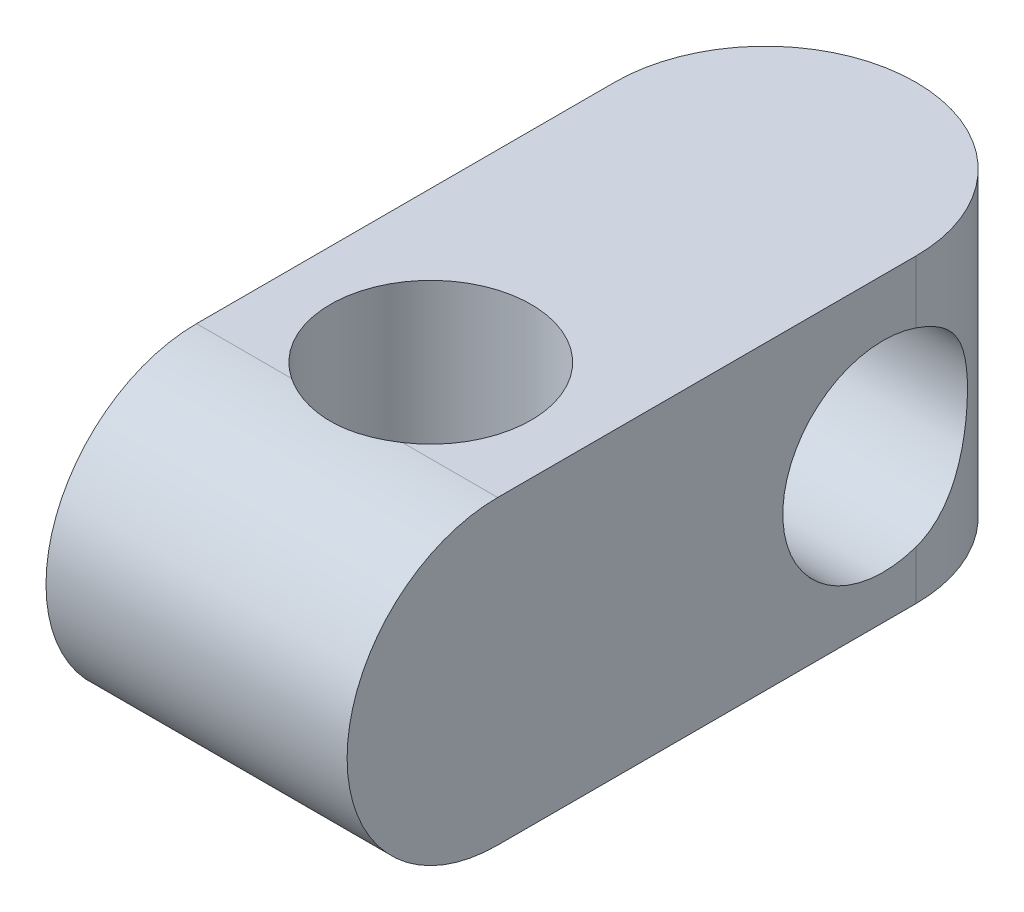
ISO-10303-21;
HEADER;
FILE_DESCRIPTION(('STEP AP214'),'2;1');
FILE_NAME('part.step','',(''),(''),'','','');
FILE_SCHEMA(('AUTOMOTIVE_DESIGN { 1 0 10303 214 1 1 1 1 }'));
ENDSEC;
DATA;
#1=APPLICATION_CONTEXT('core data for automotive mechanical design processes');
#2=APPLICATION_PROTOCOL_DEFINITION('international standard','automotive_design',2000,#1);
#3=PRODUCT_CONTEXT('',#1,'mechanical');
#4=PRODUCT('Part','Part','',(#3));
#5=PRODUCT_RELATED_PRODUCT_CATEGORY('part','',(#4));
#6=PRODUCT_DEFINITION_FORMATION('','',#4);
#7=PRODUCT_DEFINITION_CONTEXT('part definition',#1,'design');
#8=PRODUCT_DEFINITION('design','',#6,#7);
#9=PRODUCT_DEFINITION_SHAPE('','',#8);
#10=(LENGTH_UNIT() NAMED_UNIT(*) SI_UNIT(.MILLI.,.METRE.));
#11=(NAMED_UNIT(*) PLANE_ANGLE_UNIT() SI_UNIT($,.RADIAN.));
#12=(NAMED_UNIT(*) SI_UNIT($,.STERADIAN.) SOLID_ANGLE_UNIT());
#13=UNCERTAINTY_MEASURE_WITH_UNIT(LENGTH_MEASURE(1.E-05),#10,'distance_accuracy_value','');
#14=(GEOMETRIC_REPRESENTATION_CONTEXT(3) GLOBAL_UNCERTAINTY_ASSIGNED_CONTEXT((#13)) GLOBAL_UNIT_ASSIGNED_CONTEXT((#10,
#11,#12)) REPRESENTATION_CONTEXT('',''));
#15=CARTESIAN_POINT('',(0.,0.,0.));
#16=DIRECTION('',(0.,0.,1.));
#17=DIRECTION('',(1.,0.,0.));
#18=AXIS2_PLACEMENT_3D('',#15,#16,#17);
#19=CARTESIAN_POINT('',(0.,18.,-17.));
#20=DIRECTION('',(0.,-1.,0.));
#21=DIRECTION('',(0.,0.,-1.));
#22=AXIS2_PLACEMENT_3D('',#19,#20,#21);
#23=PLANE('',#22);
#24=DIRECTION('',(1.,0.,0.));
#25=VECTOR('',#24,1.);
#26=CARTESIAN_POINT('',(-9.,18.,8.));
#27=LINE('',#26,#25);
#28=CARTESIAN_POINT('',(3.31662479035542,18.,8.));
#29=VERTEX_POINT('',#28);
#30=CARTESIAN_POINT('',(9.,18.,8.));
#31=VERTEX_POINT('',#30);
#32=EDGE_CURVE('E143',#29,#31,#27,.T.);
#33=ORIENTED_EDGE('',*,*,#32,.T.);
#34=DIRECTION('',(0.,0.,-1.));
#35=VECTOR('',#34,1.);
#36=CARTESIAN_POINT('',(9.,18.,17.));
#37=LINE('',#36,#35);
#38=CARTESIAN_POINT('',(9.,18.,-17.));
#39=VERTEX_POINT('',#38);
#40=EDGE_CURVE('E149',#31,#39,#37,.T.);
#41=ORIENTED_EDGE('',*,*,#40,.T.);
#42=CARTESIAN_POINT('',(0.,18.,-17.));
#43=DIRECTION('',(0.,1.,0.));
#44=DIRECTION('',(0.,0.,-1.));
#45=AXIS2_PLACEMENT_3D('',#42,#43,#44);
#46=CIRCLE('',#45,9.);
#47=CARTESIAN_POINT('',(-9.,18.,-17.));
#48=VERTEX_POINT('',#47);
#49=EDGE_CURVE('E147',#39,#48,#46,.T.);
#50=ORIENTED_EDGE('',*,*,#49,.T.);
#51=DIRECTION('',(0.,0.,1.));
#52=VECTOR('',#51,1.);
#53=CARTESIAN_POINT('',(-9.,18.,17.));
#54=LINE('',#53,#52);
#55=CARTESIAN_POINT('',(-9.,18.,8.));
#56=VERTEX_POINT('',#55);
#57=EDGE_CURVE('E126',#48,#56,#54,.T.);
#58=ORIENTED_EDGE('',*,*,#57,.T.);
#59=CARTESIAN_POINT('',(-3.31662479035542,18.,8.));
#60=VERTEX_POINT('',#59);
#61=EDGE_CURVE('E136',#56,#60,#27,.T.);
#62=ORIENTED_EDGE('',*,*,#61,.T.);
#63=CARTESIAN_POINT('',(0.,18.,3.00000000000001));
#64=DIRECTION('',(0.,1.,0.));
#65=DIRECTION('',(0.,0.,1.));
#66=AXIS2_PLACEMENT_3D('',#63,#64,#65);
#67=CIRCLE('',#66,6.);
#68=EDGE_CURVE('E160',#29,#60,#67,.T.);
#69=ORIENTED_EDGE('',*,*,#68,.F.);
#70=EDGE_LOOP('',(#33,#41,#50,#58,#62,#69));
#71=FACE_BOUND('',#70,.T.);
#72=ADVANCED_FACE('F52',(#71),#23,.F.);
#73=CARTESIAN_POINT('',(0.,0.,-17.));
#74=DIRECTION('',(0.,-1.,0.));
#75=DIRECTION('',(0.,0.,-1.));
#76=AXIS2_PLACEMENT_3D('',#73,#74,#75);
#77=PLANE('',#76);
#78=DIRECTION('',(0.,0.,-1.));
#79=VECTOR('',#78,1.);
#80=CARTESIAN_POINT('',(9.,0.,17.));
#81=LINE('',#80,#79);
#82=CARTESIAN_POINT('',(9.,0.,8.00000000000001));
#83=VERTEX_POINT('',#82);
#84=CARTESIAN_POINT('',(9.,0.,-17.));
#85=VERTEX_POINT('',#84);
#86=EDGE_CURVE('E153',#83,#85,#81,.T.);
#87=ORIENTED_EDGE('',*,*,#86,.F.);
#88=DIRECTION('',(1.,0.,0.));
#89=VECTOR('',#88,1.);
#90=CARTESIAN_POINT('',(-9.,0.,8.00000000000001));
#91=LINE('',#90,#89);
#92=CARTESIAN_POINT('',(3.3166247903554,0.,8.00000000000001));
#93=VERTEX_POINT('',#92);
#94=EDGE_CURVE('E132',#93,#83,#91,.T.);
#95=ORIENTED_EDGE('',*,*,#94,.F.);
#96=CARTESIAN_POINT('',(0.,0.,3.00000000000001));
#97=DIRECTION('',(0.,1.,0.));
#98=DIRECTION('',(0.,0.,1.));
#99=AXIS2_PLACEMENT_3D('',#96,#97,#98);
#100=CIRCLE('',#99,6.);
#101=CARTESIAN_POINT('',(-3.3166247903554,0.,8.00000000000001));
#102=VERTEX_POINT('',#101);
#103=EDGE_CURVE('E204',#93,#102,#100,.T.);
#104=ORIENTED_EDGE('',*,*,#103,.T.);
#105=CARTESIAN_POINT('',(-9.,0.,8.00000000000001));
#106=VERTEX_POINT('',#105);
#107=EDGE_CURVE('E202',#106,#102,#91,.T.);
#108=ORIENTED_EDGE('',*,*,#107,.F.);
#109=DIRECTION('',(0.,0.,1.));
#110=VECTOR('',#109,1.);
#111=CARTESIAN_POINT('',(-9.,0.,17.));
#112=LINE('',#111,#110);
#113=CARTESIAN_POINT('',(-9.,0.,-17.));
#114=VERTEX_POINT('',#113);
#115=EDGE_CURVE('E129',#114,#106,#112,.T.);
#116=ORIENTED_EDGE('',*,*,#115,.F.);
#117=CARTESIAN_POINT('',(0.,0.,-17.));
#118=DIRECTION('',(0.,1.,0.));
#119=DIRECTION('',(0.,0.,-1.));
#120=AXIS2_PLACEMENT_3D('',#117,#118,#119);
#121=CIRCLE('',#120,9.);
#122=EDGE_CURVE('E157',#85,#114,#121,.T.);
#123=ORIENTED_EDGE('',*,*,#122,.F.);
#124=EDGE_LOOP('',(#87,#95,#104,#108,#116,#123));
#125=FACE_BOUND('',#124,.T.);
#126=ADVANCED_FACE('F210',(#125),#77,.T.);
#127=CARTESIAN_POINT('',(-9.,18.,17.));
#128=DIRECTION('',(1.,0.,0.));
#129=DIRECTION('',(0.,0.,-1.));
#130=AXIS2_PLACEMENT_3D('',#127,#128,#129);
#131=PLANE('',#130);
#132=CARTESIAN_POINT('',(-9.,9.,8.00000000000001));
#133=DIRECTION('',(1.,0.,0.));
#134=DIRECTION('',(0.,0.,-1.));
#135=AXIS2_PLACEMENT_3D('',#132,#133,#134);
#136=CIRCLE('',#135,9.);
#137=EDGE_CURVE('E121',#106,#56,#136,.F.);
#138=ORIENTED_EDGE('',*,*,#137,.T.);
#139=ORIENTED_EDGE('',*,*,#57,.F.);
#140=DIRECTION('',(0.,-1.,0.));
#141=VECTOR('',#140,1.);
#142=CARTESIAN_POINT('',(-9.,18.,-17.));
#143=LINE('',#142,#141);
#144=CARTESIAN_POINT('',(-9.,14.2787909926505,-17.));
#145=VERTEX_POINT('',#144);
#146=EDGE_CURVE('E168',#48,#145,#143,.T.);
#147=ORIENTED_EDGE('',*,*,#146,.T.);
#148=CARTESIAN_POINT('',(-9.,8.6059846401286,-15.045705220089));
#149=DIRECTION('',(1.,0.,0.));
#150=DIRECTION('',(0.,0.,-1.));
#151=AXIS2_PLACEMENT_3D('',#148,#149,#150);
#152=CIRCLE('',#151,6.);
#153=CARTESIAN_POINT('',(-9.,2.93317828760674,-17.));
#154=VERTEX_POINT('',#153);
#155=EDGE_CURVE('E78',#145,#154,#152,.T.);
#156=ORIENTED_EDGE('',*,*,#155,.T.);
#157=EDGE_CURVE('E167',#154,#114,#143,.T.);
#158=ORIENTED_EDGE('',*,*,#157,.T.);
#159=ORIENTED_EDGE('',*,*,#115,.T.);
#160=EDGE_LOOP('',(#138,#139,#147,#156,#158,#159));
#161=FACE_BOUND('',#160,.T.);
#162=ADVANCED_FACE('F123',(#161),#131,.F.);
#163=CARTESIAN_POINT('',(9.,18.,17.));
#164=DIRECTION('',(-1.,0.,0.));
#165=DIRECTION('',(0.,0.,1.));
#166=AXIS2_PLACEMENT_3D('',#163,#164,#165);
#167=PLANE('',#166);
#168=ORIENTED_EDGE('',*,*,#40,.F.);
#169=CARTESIAN_POINT('',(9.,9.,8.00000000000001));
#170=DIRECTION('',(1.,0.,0.));
#171=DIRECTION('',(0.,0.,-1.));
#172=AXIS2_PLACEMENT_3D('',#169,#170,#171);
#173=CIRCLE('',#172,9.);
#174=EDGE_CURVE('E133',#83,#31,#173,.F.);
#175=ORIENTED_EDGE('',*,*,#174,.F.);
#176=ORIENTED_EDGE('',*,*,#86,.T.);
#177=DIRECTION('',(0.,-1.,0.));
#178=VECTOR('',#177,1.);
#179=CARTESIAN_POINT('',(9.,18.,-17.));
#180=LINE('',#179,#178);
#181=CARTESIAN_POINT('',(9.,2.93317828760674,-17.));
#182=VERTEX_POINT('',#181);
#183=EDGE_CURVE('E151',#182,#85,#180,.T.);
#184=ORIENTED_EDGE('',*,*,#183,.F.);
#185=CARTESIAN_POINT('',(9.,8.6059846401286,-15.045705220089));
#186=DIRECTION('',(1.,0.,0.));
#187=DIRECTION('',(0.,0.,-1.));
#188=AXIS2_PLACEMENT_3D('',#185,#186,#187);
#189=CIRCLE('',#188,6.);
#190=CARTESIAN_POINT('',(9.,14.2787909926505,-17.));
#191=VERTEX_POINT('',#190);
#192=EDGE_CURVE('E72',#191,#182,#189,.T.);
#193=ORIENTED_EDGE('',*,*,#192,.F.);
#194=EDGE_CURVE('E164',#39,#191,#180,.T.);
#195=ORIENTED_EDGE('',*,*,#194,.F.);
#196=EDGE_LOOP('',(#168,#175,#176,#184,#193,#195));
#197=FACE_BOUND('',#196,.T.);
#198=ADVANCED_FACE('F216',(#197),#167,.F.);
#199=CARTESIAN_POINT('',(0.,18.,-17.));
#200=DIRECTION('',(0.,-1.,0.));
#201=DIRECTION('',(0.,0.,-1.));
#202=AXIS2_PLACEMENT_3D('',#199,#200,#201);
#203=CYLINDRICAL_SURFACE('',#202,9.);
#204=ORIENTED_EDGE('',*,*,#194,.T.);
#205=CARTESIAN_POINT('',(9.,14.2787909926505,-17.));
#206=CARTESIAN_POINT('',(9.00002680249669,14.2264889856167,-17.1519062461776));
#207=CARTESIAN_POINT('',(8.99615526296472,14.1680492812687,-17.301647707132));
#208=CARTESIAN_POINT('',(8.98146932234134,14.0395617232193,-17.5955782971516));
#209=CARTESIAN_POINT('',(8.97066042379701,13.9695231021397,-17.7397717307859));
#210=CARTESIAN_POINT('',(8.94302310240633,13.818813638398,-18.0208936631936));
#211=CARTESIAN_POINT('',(8.92622632538362,13.738200073522,-18.157856089541));
#212=CARTESIAN_POINT('',(8.88757590175191,13.5667324982953,-18.4244781674708));
#213=CARTESIAN_POINT('',(8.86572135338571,13.4758766633192,-18.5541365116662));
#214=CARTESIAN_POINT('',(8.81805508090137,13.2848941379763,-18.8050376684637));
#215=CARTESIAN_POINT('',(8.79225539488641,13.1847960055743,-18.9263045044667));
#216=CARTESIAN_POINT('',(8.73771740553711,12.9757723311553,-19.1602654058769));
#217=CARTESIAN_POINT('',(8.70897808089633,12.8668437239484,-19.2729564679621));
#218=CARTESIAN_POINT('',(8.61987640306991,12.5273730785661,-19.5977048566009));
#219=CARTESIAN_POINT('',(8.55666798619637,12.2842863309737,-19.7962539914201));
#220=CARTESIAN_POINT('',(8.46052270843743,11.8887700518406,-20.0708317265394));
#221=CARTESIAN_POINT('',(8.42704238565806,11.7461066091915,-20.1611926361908));
#222=CARTESIAN_POINT('',(8.36187999686458,11.4533606770948,-20.3297306608197));
#223=CARTESIAN_POINT('',(8.33019732091114,11.3032807367851,-20.4079119242442));
#224=CARTESIAN_POINT('',(8.26999482967454,10.9965389427098,-20.5515148167119));
#225=CARTESIAN_POINT('',(8.24147488001777,10.8398773689659,-20.6169369879358));
#226=CARTESIAN_POINT('',(8.18890236807694,10.5209730647088,-20.7344372706217));
#227=CARTESIAN_POINT('',(8.16484759771514,10.3587331400472,-20.7865219824587));
#228=CARTESIAN_POINT('',(8.12257255404364,10.031407092162,-20.8763720497251));
#229=CARTESIAN_POINT('',(8.10429474153149,9.86636749201103,-20.9142793585704));
#230=CARTESIAN_POINT('',(8.07416143297473,9.5330948544248,-20.9760663761829));
#231=CARTESIAN_POINT('',(8.06230586712885,9.36486185171817,-20.9999462374099));
#232=CARTESIAN_POINT('',(8.04565067425776,9.02673901470111,-21.0333430053237));
#233=CARTESIAN_POINT('',(8.04084629250322,8.85685037470002,-21.0428695907755));
#234=CARTESIAN_POINT('',(8.03854147004486,8.51683571784703,-21.0474511196505));
#235=CARTESIAN_POINT('',(8.04104043913545,8.34670972128716,-21.0425072324757));
#236=CARTESIAN_POINT('',(8.05259591088297,8.02459918805144,-21.0194325576457));
#237=CARTESIAN_POINT('',(8.06097665784981,7.87249062263523,-21.0026598810329));
#238=CARTESIAN_POINT('',(8.08318297203158,7.57033830711796,-20.9576233962568));
#239=CARTESIAN_POINT('',(8.09701038097582,7.42029527323357,-20.9293557010736));
#240=CARTESIAN_POINT('',(8.12953198798703,7.1233145649949,-20.861621307532));
#241=CARTESIAN_POINT('',(8.14822570611514,6.97637658594939,-20.8221557135297));
#242=CARTESIAN_POINT('',(8.18973243319578,6.68642574628646,-20.7323875442608));
#243=CARTESIAN_POINT('',(8.21254698663731,6.54341438059477,-20.6820809044007));
#244=CARTESIAN_POINT('',(8.28714970462074,6.11428030559465,-20.5126496291328));
#245=CARTESIAN_POINT('',(8.34421114633859,5.83552725170865,-20.3767213307902));
#246=CARTESIAN_POINT('',(8.4639514940581,5.30295030071454,-20.0642155927605));
#247=CARTESIAN_POINT('',(8.52663509882803,5.04914763444642,-19.8876039546506));
#248=CARTESIAN_POINT('',(8.62153930859797,4.67858069537458,-19.5849171408603));
#249=CARTESIAN_POINT('',(8.65481466752412,4.55140399900199,-19.4716978072402));
#250=CARTESIAN_POINT('',(8.71905040786818,4.30685372652779,-19.2345546671223));
#251=CARTESIAN_POINT('',(8.75001161115221,4.18947666836178,-19.1106346949508));
#252=CARTESIAN_POINT('',(8.80818413796436,3.96548690839111,-18.8529195296297));
#253=CARTESIAN_POINT('',(8.83540089318908,3.85885867570072,-18.719139082433));
#254=CARTESIAN_POINT('',(8.8847750638027,3.6570699987883,-18.4424054840576));
#255=CARTESIAN_POINT('',(8.90693442476129,3.56190515129983,-18.299455887436));
#256=CARTESIAN_POINT('',(8.94928454086008,3.36334695379409,-17.971354895875));
#257=CARTESIAN_POINT('',(8.96785072210595,3.26309399536422,-17.7840582773733));
#258=CARTESIAN_POINT('',(8.98687162153226,3.12784106307976,-17.4954553521615));
#259=CARTESIAN_POINT('',(8.99174081369484,3.08525512581756,-17.397912265226));
#260=CARTESIAN_POINT('',(8.99830708399825,3.00527825262376,-17.200566344209));
#261=CARTESIAN_POINT('',(9.00000277817231,2.96788958980722,-17.1007625434206));
#262=CARTESIAN_POINT('',(9.,2.93317828760673,-17.));
#263=B_SPLINE_CURVE_WITH_KNOTS('',3,(#205,#206,#207,#208,#209,#210,#211,#212,#213,#214,#215,
#216,#217,#218,#219,#220,#221,#222,#223,#224,#225,#226,#227,#228,#229,#230,#231,#232,#233,#234,
#235,#236,#237,#238,#239,#240,#241,#242,#243,#244,#245,#246,#247,#248,#249,#250,#251,#252,#253,
#254,#255,#256,#257,#258,#259,#260,#261,#262),.UNSPECIFIED.,.F.,.F.,(4,2,2,2,2,2,2,2,2,2,2,2,2,
2,2,2,2,2,2,2,2,2,2,2,2,2,2,2,4),(0.,0.481726002408597,0.963070382694413,1.44190768843516,
1.9208304326172,2.39831993651796,2.8759758997443,3.83198206884713,4.34800082381948,
4.86384343418581,5.37966411972679,5.89522904303772,6.40548404805899,6.9157335071758,
7.4256387383591,7.93550276371725,8.39474079362464,8.85413424334694,9.31348240262612,
9.77300308418785,10.7149226482935,11.657636898281,12.1775821085753,12.697341775572,
13.2163393451631,13.7351369195937,14.3732393516471,14.6927053910073,15.0123107175048),.UNSPECIFIED.);
#264=EDGE_CURVE('E12',#191,#182,#263,.T.);
#265=ORIENTED_EDGE('',*,*,#264,.T.);
#266=ORIENTED_EDGE('',*,*,#183,.T.);
#267=ORIENTED_EDGE('',*,*,#122,.T.);
#268=ORIENTED_EDGE('',*,*,#157,.F.);
#269=CARTESIAN_POINT('',(-9.,2.93317828760674,-17.));
#270=CARTESIAN_POINT('',(-9.00002680249669,2.98548029464056,-17.1519062461776));
#271=CARTESIAN_POINT('',(-8.99615526296472,3.04391999898847,-17.301647707132));
#272=CARTESIAN_POINT('',(-8.98146932234134,3.17240755703794,-17.5955782971516));
#273=CARTESIAN_POINT('',(-8.97066042379702,3.24244617811749,-17.7397717307859));
#274=CARTESIAN_POINT('',(-8.94302310240633,3.3931556418592,-18.0208936631936));
#275=CARTESIAN_POINT('',(-8.92622632538362,3.47376920673526,-18.157856089541));
#276=CARTESIAN_POINT('',(-8.88757590175192,3.64523678196188,-18.4244781674708));
#277=CARTESIAN_POINT('',(-8.86572135338571,3.73609261693798,-18.5541365116662));
#278=CARTESIAN_POINT('',(-8.81805508090138,3.92707514228088,-18.8050376684637));
#279=CARTESIAN_POINT('',(-8.79225539488642,4.02717327468288,-18.9263045044667));
#280=CARTESIAN_POINT('',(-8.73771740553711,4.23619694910193,-19.1602654058769));
#281=CARTESIAN_POINT('',(-8.70897808089634,4.34512555630878,-19.2729564679621));
#282=CARTESIAN_POINT('',(-8.61987640306992,4.68459620169111,-19.5977048566009));
#283=CARTESIAN_POINT('',(-8.55666798619638,4.92768294928353,-19.7962539914201));
#284=CARTESIAN_POINT('',(-8.46052270843743,5.3231992284166,-20.0708317265394));
#285=CARTESIAN_POINT('',(-8.42704238565806,5.46586267106566,-20.1611926361908));
#286=CARTESIAN_POINT('',(-8.36187999686459,5.75860860316245,-20.3297306608197));
#287=CARTESIAN_POINT('',(-8.33019732091114,5.90868854347207,-20.4079119242442));
#288=CARTESIAN_POINT('',(-8.26999482967455,6.21543033754737,-20.5515148167119));
#289=CARTESIAN_POINT('',(-8.24147488001778,6.37209191129128,-20.6169369879358));
#290=CARTESIAN_POINT('',(-8.18890236807694,6.69099621554839,-20.7344372706217));
#291=CARTESIAN_POINT('',(-8.16484759771514,6.85323614020999,-20.7865219824587));
#292=CARTESIAN_POINT('',(-8.12257255404364,7.1805621880952,-20.8763720497251));
#293=CARTESIAN_POINT('',(-8.10429474153149,7.34560178824618,-20.9142793585704));
#294=CARTESIAN_POINT('',(-8.07416143297473,7.6788744258324,-20.9760663761829));
#295=CARTESIAN_POINT('',(-8.06230586712885,7.84710742853904,-20.9999462374099));
#296=CARTESIAN_POINT('',(-8.04565067425776,8.1852302655561,-21.0333430053237));
#297=CARTESIAN_POINT('',(-8.04084629250322,8.35511890555719,-21.0428695907755));
#298=CARTESIAN_POINT('',(-8.03854147004486,8.69513356241018,-21.0474511196505));
#299=CARTESIAN_POINT('',(-8.04104043913546,8.86525955897005,-21.0425072324757));
#300=CARTESIAN_POINT('',(-8.05259591088297,9.18737009220577,-21.0194325576457));
#301=CARTESIAN_POINT('',(-8.06097665784981,9.33947865762198,-21.0026598810329));
#302=CARTESIAN_POINT('',(-8.08318297203158,9.64163097313924,-20.9576233962568));
#303=CARTESIAN_POINT('',(-8.09701038097582,9.79167400702364,-20.9293557010736));
#304=CARTESIAN_POINT('',(-8.12953198798703,10.0886547152623,-20.861621307532));
#305=CARTESIAN_POINT('',(-8.14822570611514,10.2355926943078,-20.8221557135297));
#306=CARTESIAN_POINT('',(-8.18973243319578,10.5255435339707,-20.7323875442608));
#307=CARTESIAN_POINT('',(-8.21254698663732,10.6685548996624,-20.6820809044007));
#308=CARTESIAN_POINT('',(-8.28714970462074,11.0976889746626,-20.5126496291328));
#309=CARTESIAN_POINT('',(-8.34421114633859,11.3764420285486,-20.3767213307902));
#310=CARTESIAN_POINT('',(-8.4639514940581,11.9090189795427,-20.0642155927605));
#311=CARTESIAN_POINT('',(-8.52663509882803,12.1628216458108,-19.8876039546506));
#312=CARTESIAN_POINT('',(-8.62153930859797,12.5333885848826,-19.5849171408603));
#313=CARTESIAN_POINT('',(-8.65481466752413,12.6605652812552,-19.4716978072402));
#314=CARTESIAN_POINT('',(-8.71905040786819,12.9051155537294,-19.2345546671223));
#315=CARTESIAN_POINT('',(-8.75001161115221,13.0224926118954,-19.1106346949508));
#316=CARTESIAN_POINT('',(-8.80818413796437,13.2464823718661,-18.8529195296297));
#317=CARTESIAN_POINT('',(-8.83540089318909,13.3531106045565,-18.719139082433));
#318=CARTESIAN_POINT('',(-8.8847750638027,13.5548992814689,-18.4424054840575));
#319=CARTESIAN_POINT('',(-8.90693442476129,13.6500641289574,-18.299455887436));
#320=CARTESIAN_POINT('',(-8.94928454086009,13.8486223264631,-17.971354895875));
#321=CARTESIAN_POINT('',(-8.96785072210596,13.948875284893,-17.7840582773733));
#322=CARTESIAN_POINT('',(-8.98687162153226,14.0841282171775,-17.4954553521615));
#323=CARTESIAN_POINT('',(-8.99174081369484,14.1267141544396,-17.397912265226));
#324=CARTESIAN_POINT('',(-8.99830708399825,14.2066910276335,-17.200566344209));
#325=CARTESIAN_POINT('',(-9.00000277817231,14.24407969045,-17.1007625434206));
#326=CARTESIAN_POINT('',(-9.,14.2787909926505,-17.));
#327=B_SPLINE_CURVE_WITH_KNOTS('',3,(#269,#270,#271,#272,#273,#274,#275,#276,#277,#278,#279,
#280,#281,#282,#283,#284,#285,#286,#287,#288,#289,#290,#291,#292,#293,#294,#295,#296,#297,#298,
#299,#300,#301,#302,#303,#304,#305,#306,#307,#308,#309,#310,#311,#312,#313,#314,#315,#316,#317,
#318,#319,#320,#321,#322,#323,#324,#325,#326),.UNSPECIFIED.,.F.,.F.,(4,2,2,2,2,2,2,2,2,2,2,2,2,
2,2,2,2,2,2,2,2,2,2,2,2,2,2,2,4),(0.,0.481726002408597,0.963070382694412,1.44190768843517,
1.9208304326172,2.39831993651795,2.87597589974429,3.83198206884713,4.34800082381948,
4.86384343418581,5.37966411972679,5.89522904303772,6.40548404805899,6.9157335071758,
7.4256387383591,7.93550276371725,8.39474079362464,8.85413424334694,9.31348240262612,
9.77300308418785,10.7149226482935,11.657636898281,12.1775821085753,12.697341775572,
13.2163393451631,13.7351369195937,14.3732393516471,14.6927053910073,15.0123107175048),.UNSPECIFIED.);
#328=EDGE_CURVE('E66',#154,#145,#327,.T.);
#329=ORIENTED_EDGE('',*,*,#328,.T.);
#330=ORIENTED_EDGE('',*,*,#146,.F.);
#331=ORIENTED_EDGE('',*,*,#49,.F.);
#332=EDGE_LOOP('',(#204,#265,#266,#267,#268,#329,#330,#331));
#333=FACE_BOUND('',#332,.T.);
#334=ADVANCED_FACE('F54',(#333),#203,.T.);
#335=CARTESIAN_POINT('',(0.,18.,3.00000000000001));
#336=DIRECTION('',(0.,-1.,0.));
#337=DIRECTION('',(0.,0.,-1.));
#338=AXIS2_PLACEMENT_3D('',#335,#336,#337);
#339=CYLINDRICAL_SURFACE('',#338,6.);
#340=CARTESIAN_POINT('',(3.31662479035542,18.,8.));
#341=CARTESIAN_POINT('',(3.17617454819525,17.999982806864,8.09318572475784));
#342=CARTESIAN_POINT('',(3.03179220570029,17.9985517066378,8.18041457473508));
#343=CARTESIAN_POINT('',(2.73624365762433,17.9938538635766,8.34240644879357));
#344=CARTESIAN_POINT('',(2.58507823469343,17.9905873320201,8.41717090638002));
#345=CARTESIAN_POINT('',(2.27709346081338,17.9832123108246,8.55366709232569));
#346=CARTESIAN_POINT('',(2.12027717825462,17.9791042726076,8.61540577240047));
#347=CARTESIAN_POINT('',(1.80200819212656,17.9708825476637,8.72547944319332));
#348=CARTESIAN_POINT('',(1.64055547275025,17.9667688609177,8.77381438820805));
#349=CARTESIAN_POINT('',(1.31408707738531,17.9592248757396,8.85675255431895));
#350=CARTESIAN_POINT('',(1.14907023624716,17.9557948046545,8.89135121098029));
#351=CARTESIAN_POINT('',(0.816691049181626,17.9501298620152,8.94654482542437));
#352=CARTESIAN_POINT('',(0.64932872217382,17.9478949808258,8.96713989609901));
#353=CARTESIAN_POINT('',(0.313473459027933,17.9449318159267,8.99417324086133));
#354=CARTESIAN_POINT('',(0.144980678541134,17.944203328907,9.00061342536655));
#355=CARTESIAN_POINT('',(-0.191943927921939,17.9443507654365,8.99929467649973));
#356=CARTESIAN_POINT('',(-0.360375755491912,17.9452266434683,8.99153614596046));
#357=CARTESIAN_POINT('',(-0.695500721853941,17.9484595965048,8.96192047077919));
#358=CARTESIAN_POINT('',(-0.862197425550741,17.9508124852322,8.94010316816302));
#359=CARTESIAN_POINT('',(-1.19316902012904,17.95666871348,8.88256441467656));
#360=CARTESIAN_POINT('',(-1.35744367391195,17.9601721648598,8.84684161182999));
#361=CARTESIAN_POINT('',(-1.68230231590687,17.9678047843502,8.76177347906371));
#362=CARTESIAN_POINT('',(-1.84288852223921,17.9719335644246,8.71243658162452));
#363=CARTESIAN_POINT('',(-2.15930580326337,17.980119476786,8.6004958667899));
#364=CARTESIAN_POINT('',(-2.31513858875221,17.9841766346236,8.53789688854961));
#365=CARTESIAN_POINT('',(-2.61564199671987,17.9912531252532,8.40227854840946));
#366=CARTESIAN_POINT('',(-2.76051244199588,17.9943039536125,8.32970337136369));
#367=CARTESIAN_POINT('',(-3.04365950531982,17.9986685453732,8.17322897716632));
#368=CARTESIAN_POINT('',(-3.18194841207301,17.9999856791892,8.08935208246165));
#369=CARTESIAN_POINT('',(-3.31662479035542,18.,8.));
#370=B_SPLINE_CURVE_WITH_KNOTS('',3,(#340,#341,#342,#343,#344,#345,#346,#347,#348,#349,#350,
#351,#352,#353,#354,#355,#356,#357,#358,#359,#360,#361,#362,#363,#364,#365,#366,#367,#368,#369),
.UNSPECIFIED.,.F.,.F.,(4,2,2,2,2,2,2,2,2,2,2,2,2,2,4),(0.,0.505478352133195,1.01089853003348,
1.5160482845355,2.02119976144932,2.52651895507016,3.03183407494048,3.53708099064754,
4.04231357217974,4.54612060348861,5.04997663018364,5.55352126960013,6.05688248782415,
6.54253134219249,7.02723466241767),.UNSPECIFIED.);
#371=EDGE_CURVE('E139',#29,#60,#370,.T.);
#372=ORIENTED_EDGE('',*,*,#371,.F.);
#373=ORIENTED_EDGE('',*,*,#68,.T.);
#374=EDGE_LOOP('',(#372,#373));
#375=FACE_BOUND('',#374,.T.);
#376=CARTESIAN_POINT('',(-3.3166247903554,0.,8.00000000000001));
#377=CARTESIAN_POINT('',(-3.17617454819523,1.71931359580589E-05,8.09318572475786));
#378=CARTESIAN_POINT('',(-3.03179220570027,0.00144829336218984,8.1804145747351));
#379=CARTESIAN_POINT('',(-2.7362436576243,0.00614613642336786,8.34240644879358));
#380=CARTESIAN_POINT('',(-2.58507823469341,0.00941266797986546,8.41717090638003));
#381=CARTESIAN_POINT('',(-2.27709346081335,0.0167876891754123,8.55366709232569));
#382=CARTESIAN_POINT('',(-2.12027717825459,0.0208957273924417,8.61540577240048));
#383=CARTESIAN_POINT('',(-1.80200819212653,0.029117452336266,8.72547944319333));
#384=CARTESIAN_POINT('',(-1.64055547275023,0.0332311390822729,8.77381438820805));
#385=CARTESIAN_POINT('',(-1.31408707738529,0.0407751242604227,8.85675255431896));
#386=CARTESIAN_POINT('',(-1.14907023624713,0.0442051953455029,8.89135121098029));
#387=CARTESIAN_POINT('',(-0.816691049181601,0.0498701379848,8.94654482542437));
#388=CARTESIAN_POINT('',(-0.649328722173795,0.0521050191741784,8.96713989609901));
#389=CARTESIAN_POINT('',(-0.313473459027907,0.055068184073253,8.99417324086133));
#390=CARTESIAN_POINT('',(-0.144980678541108,0.055796671093008,9.00061342536655));
#391=CARTESIAN_POINT('',(0.191943927921965,0.0556492345634473,8.99929467649973));
#392=CARTESIAN_POINT('',(0.360375755491938,0.0547733565316889,8.99153614596046));
#393=CARTESIAN_POINT('',(0.695500721853966,0.0515404034951706,8.96192047077919));
#394=CARTESIAN_POINT('',(0.862197425550767,0.0491875147677629,8.94010316816301));
#395=CARTESIAN_POINT('',(1.19316902012906,0.0433312865199941,8.88256441467656));
#396=CARTESIAN_POINT('',(1.35744367391198,0.0398278351401981,8.84684161182999));
#397=CARTESIAN_POINT('',(1.68230231590689,0.0321952156497573,8.76177347906371));
#398=CARTESIAN_POINT('',(1.84288852223923,0.0280664355754238,8.71243658162451));
#399=CARTESIAN_POINT('',(2.15930580326339,0.0198805232140493,8.60049586678989));
#400=CARTESIAN_POINT('',(2.31513858875224,0.0158233653764108,8.5378968885496));
#401=CARTESIAN_POINT('',(2.61564199671988,0.00874687474677773,8.40227854840945));
#402=CARTESIAN_POINT('',(2.76051244199589,0.00569604638754501,8.32970337136368));
#403=CARTESIAN_POINT('',(3.04365950531982,0.00133145462678982,8.17322897716633));
#404=CARTESIAN_POINT('',(3.18194841207299,1.43208107844856E-05,8.08935208246166));
#405=CARTESIAN_POINT('',(3.3166247903554,0.,8.00000000000001));
#406=B_SPLINE_CURVE_WITH_KNOTS('',3,(#376,#377,#378,#379,#380,#381,#382,#383,#384,#385,#386,
#387,#388,#389,#390,#391,#392,#393,#394,#395,#396,#397,#398,#399,#400,#401,#402,#403,#404,#405),
.UNSPECIFIED.,.F.,.F.,(4,2,2,2,2,2,2,2,2,2,2,2,2,2,4),(0.,0.505478352133196,1.01089853003348,
1.5160482845355,2.02119976144932,2.52651895507016,3.03183407494048,3.53708099064754,
4.04231357217975,4.54612060348861,5.04997663018364,5.55352126960013,6.05688248782415,
6.54253134219247,7.02723466241762),.UNSPECIFIED.);
#407=EDGE_CURVE('E170',#102,#93,#406,.T.);
#408=ORIENTED_EDGE('',*,*,#407,.F.);
#409=ORIENTED_EDGE('',*,*,#103,.F.);
#410=EDGE_LOOP('',(#408,#409));
#411=FACE_BOUND('',#410,.T.);
#412=ADVANCED_FACE('F182',(#375,#411),#339,.F.);
#413=CARTESIAN_POINT('',(-9.,9.,8.00000000000001));
#414=DIRECTION('',(1.,0.,0.));
#415=DIRECTION('',(0.,0.,-1.));
#416=AXIS2_PLACEMENT_3D('',#413,#414,#415);
#417=CYLINDRICAL_SURFACE('',#416,9.);
#418=ORIENTED_EDGE('',*,*,#407,.T.);
#419=ORIENTED_EDGE('',*,*,#94,.T.);
#420=ORIENTED_EDGE('',*,*,#174,.T.);
#421=ORIENTED_EDGE('',*,*,#32,.F.);
#422=ORIENTED_EDGE('',*,*,#371,.T.);
#423=ORIENTED_EDGE('',*,*,#61,.F.);
#424=ORIENTED_EDGE('',*,*,#137,.F.);
#425=ORIENTED_EDGE('',*,*,#107,.T.);
#426=EDGE_LOOP('',(#418,#419,#420,#421,#422,#423,#424,#425));
#427=FACE_BOUND('',#426,.T.);
#428=ADVANCED_FACE('F137',(#427),#417,.T.);
#429=CARTESIAN_POINT('',(-9.,8.6059846401286,-15.045705220089));
#430=DIRECTION('',(1.,0.,0.));
#431=DIRECTION('',(0.,0.,-1.));
#432=AXIS2_PLACEMENT_3D('',#429,#430,#431);
#433=CYLINDRICAL_SURFACE('',#432,6.);
#434=ORIENTED_EDGE('',*,*,#155,.F.);
#435=ORIENTED_EDGE('',*,*,#328,.F.);
#436=EDGE_LOOP('',(#434,#435));
#437=FACE_BOUND('',#436,.T.);
#438=ORIENTED_EDGE('',*,*,#192,.T.);
#439=ORIENTED_EDGE('',*,*,#264,.F.);
#440=EDGE_LOOP('',(#438,#439));
#441=FACE_BOUND('',#440,.T.);
#442=ADVANCED_FACE('F187',(#437,#441),#433,.F.);
#443=CLOSED_SHELL('',(#72,#126,#162,#198,#334,#412,#428,#442));
#444=MANIFOLD_SOLID_BREP('B2',#443);
#445=ADVANCED_BREP_SHAPE_REPRESENTATION('',(#18,#444),#14);
#446=SHAPE_DEFINITION_REPRESENTATION(#9,#445);
ENDSEC;
END-ISO-10303-21;
